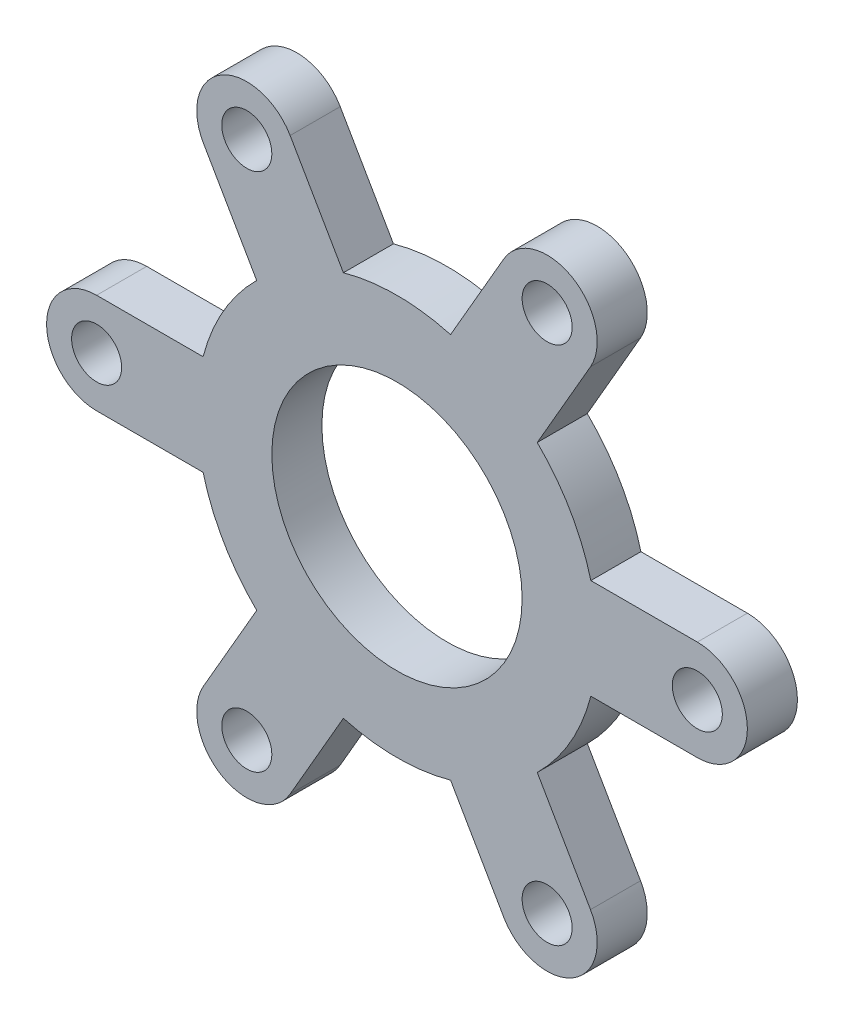
ISO-10303-21;
HEADER;
FILE_DESCRIPTION(('STEP AP214'),'2;1');
FILE_NAME('part.step','',(''),(''),'','','');
FILE_SCHEMA(('AUTOMOTIVE_DESIGN { 1 0 10303 214 1 1 1 1 }'));
ENDSEC;
DATA;
#1=APPLICATION_CONTEXT('core data for automotive mechanical design processes');
#2=APPLICATION_PROTOCOL_DEFINITION('international standard','automotive_design',2000,#1);
#3=PRODUCT_CONTEXT('',#1,'mechanical');
#4=PRODUCT('Part','Part','',(#3));
#5=PRODUCT_RELATED_PRODUCT_CATEGORY('part','',(#4));
#6=PRODUCT_DEFINITION_FORMATION('','',#4);
#7=PRODUCT_DEFINITION_CONTEXT('part definition',#1,'design');
#8=PRODUCT_DEFINITION('design','',#6,#7);
#9=PRODUCT_DEFINITION_SHAPE('','',#8);
#10=(LENGTH_UNIT() NAMED_UNIT(*) SI_UNIT(.MILLI.,.METRE.));
#11=(NAMED_UNIT(*) PLANE_ANGLE_UNIT() SI_UNIT($,.RADIAN.));
#12=(NAMED_UNIT(*) SI_UNIT($,.STERADIAN.) SOLID_ANGLE_UNIT());
#13=UNCERTAINTY_MEASURE_WITH_UNIT(LENGTH_MEASURE(1.E-05),#10,'distance_accuracy_value','');
#14=(GEOMETRIC_REPRESENTATION_CONTEXT(3) GLOBAL_UNCERTAINTY_ASSIGNED_CONTEXT((#13)) GLOBAL_UNIT_ASSIGNED_CONTEXT((#10,
#11,#12)) REPRESENTATION_CONTEXT('',''));
#15=CARTESIAN_POINT('',(0.,0.,0.));
#16=DIRECTION('',(0.,0.,1.));
#17=DIRECTION('',(1.,0.,0.));
#18=AXIS2_PLACEMENT_3D('',#15,#16,#17);
#19=CARTESIAN_POINT('',(60.,0.,10.));
#20=DIRECTION('',(0.,0.,1.));
#21=DIRECTION('',(1.,0.,0.));
#22=AXIS2_PLACEMENT_3D('',#19,#20,#21);
#23=PLANE('',#22);
#24=CARTESIAN_POINT('',(-30.0000000000002,51.9615242270651,10.));
#25=DIRECTION('',(0.,0.,1.));
#26=DIRECTION('',(1.,0.,0.));
#27=AXIS2_PLACEMENT_3D('',#24,#25,#26);
#28=CIRCLE('',#27,5.00000000000052);
#29=CARTESIAN_POINT('',(-24.9999999999997,51.9615242270651,10.));
#30=VERTEX_POINT('',#29);
#31=EDGE_CURVE('E459',#30,#30,#28,.T.);
#32=ORIENTED_EDGE('',*,*,#31,.F.);
#33=EDGE_LOOP('',(#32));
#34=FACE_BOUND('',#33,.T.);
#35=CARTESIAN_POINT('',(-30.0000000000002,-51.9615242270662,10.));
#36=DIRECTION('',(0.,0.,1.));
#37=DIRECTION('',(1.,0.,0.));
#38=AXIS2_PLACEMENT_3D('',#35,#36,#37);
#39=CIRCLE('',#38,5.00000000000001);
#40=CARTESIAN_POINT('',(-25.0000000000002,-51.9615242270662,10.));
#41=VERTEX_POINT('',#40);
#42=EDGE_CURVE('E471',#41,#41,#39,.T.);
#43=ORIENTED_EDGE('',*,*,#42,.F.);
#44=EDGE_LOOP('',(#43));
#45=FACE_BOUND('',#44,.T.);
#46=CARTESIAN_POINT('',(60.,0.,10.));
#47=DIRECTION('',(0.,0.,1.));
#48=DIRECTION('',(1.,0.,0.));
#49=AXIS2_PLACEMENT_3D('',#46,#47,#48);
#50=CIRCLE('',#49,5.);
#51=CARTESIAN_POINT('',(65.,0.,10.));
#52=VERTEX_POINT('',#51);
#53=EDGE_CURVE('E483',#52,#52,#50,.T.);
#54=ORIENTED_EDGE('',*,*,#53,.F.);
#55=EDGE_LOOP('',(#54));
#56=FACE_BOUND('',#55,.T.);
#57=CARTESIAN_POINT('',(60.,0.,10.));
#58=DIRECTION('',(0.,0.,1.));
#59=DIRECTION('',(1.,0.,0.));
#60=AXIS2_PLACEMENT_3D('',#57,#58,#59);
#61=CIRCLE('',#60,9.99999999999999);
#62=CARTESIAN_POINT('',(60.,-9.99999999999999,10.));
#63=VERTEX_POINT('',#62);
#64=CARTESIAN_POINT('',(60.,9.99999999999999,10.));
#65=VERTEX_POINT('',#64);
#66=EDGE_CURVE('E273',#63,#65,#61,.T.);
#67=ORIENTED_EDGE('',*,*,#66,.T.);
#68=DIRECTION('',(-1.,0.,0.));
#69=VECTOR('',#68,1.);
#70=CARTESIAN_POINT('',(60.,9.99999999999999,10.));
#71=LINE('',#70,#69);
#72=CARTESIAN_POINT('',(38.7298334620742,9.99999999999999,10.));
#73=VERTEX_POINT('',#72);
#74=EDGE_CURVE('E141',#65,#73,#71,.T.);
#75=ORIENTED_EDGE('',*,*,#74,.T.);
#76=CARTESIAN_POINT('',(0.,0.,10.));
#77=DIRECTION('',(0.,0.,1.));
#78=DIRECTION('',(1.,0.,0.));
#79=AXIS2_PLACEMENT_3D('',#76,#77,#78);
#80=CIRCLE('',#79,40.);
#81=CARTESIAN_POINT('',(28.0251707688818,28.5410196624965,10.));
#82=VERTEX_POINT('',#81);
#83=EDGE_CURVE('E336',#73,#82,#80,.T.);
#84=ORIENTED_EDGE('',*,*,#83,.T.);
#85=DIRECTION('',(0.50000000000001,0.866025403784433,0.));
#86=VECTOR('',#85,1.);
#87=CARTESIAN_POINT('',(38.6602540378449,46.9615242270659,10.));
#88=LINE('',#87,#86);
#89=CARTESIAN_POINT('',(38.6602540378449,46.9615242270659,10.));
#90=VERTEX_POINT('',#89);
#91=EDGE_CURVE('E355',#82,#90,#88,.T.);
#92=ORIENTED_EDGE('',*,*,#91,.T.);
#93=CARTESIAN_POINT('',(30.0000000000006,51.961524227066,10.));
#94=DIRECTION('',(0.,0.,1.));
#95=DIRECTION('',(1.,0.,0.));
#96=AXIS2_PLACEMENT_3D('',#93,#94,#95);
#97=CIRCLE('',#96,9.99999999999999);
#98=CARTESIAN_POINT('',(21.3397459621563,56.9615242270661,10.));
#99=VERTEX_POINT('',#98);
#100=EDGE_CURVE('E352',#90,#99,#97,.T.);
#101=ORIENTED_EDGE('',*,*,#100,.T.);
#102=DIRECTION('',(-0.50000000000001,-0.866025403784433,0.));
#103=VECTOR('',#102,1.);
#104=CARTESIAN_POINT('',(21.3397459621563,56.9615242270661,10.));
#105=LINE('',#104,#103);
#106=CARTESIAN_POINT('',(10.7046626931932,38.5410196624967,10.));
#107=VERTEX_POINT('',#106);
#108=EDGE_CURVE('E354',#99,#107,#105,.T.);
#109=ORIENTED_EDGE('',*,*,#108,.T.);
#110=CARTESIAN_POINT('',(0.,0.,10.));
#111=DIRECTION('',(0.,0.,1.));
#112=DIRECTION('',(1.,0.,0.));
#113=AXIS2_PLACEMENT_3D('',#110,#111,#112);
#114=CIRCLE('',#113,40.);
#115=CARTESIAN_POINT('',(-10.7046626931923,38.5410196624969,10.));
#116=VERTEX_POINT('',#115);
#117=EDGE_CURVE('E357',#107,#116,#114,.T.);
#118=ORIENTED_EDGE('',*,*,#117,.T.);
#119=DIRECTION('',(-0.500000000000049,0.86602540378441,0.));
#120=VECTOR('',#119,1.);
#121=CARTESIAN_POINT('',(-21.3397459621559,56.9615242270651,10.));
#122=LINE('',#121,#120);
#123=CARTESIAN_POINT('',(-21.3397459621559,56.9615242270651,10.));
#124=VERTEX_POINT('',#123);
#125=EDGE_CURVE('E363',#116,#124,#122,.T.);
#126=ORIENTED_EDGE('',*,*,#125,.T.);
#127=CARTESIAN_POINT('',(-30.0000000000002,51.9615242270651,10.));
#128=DIRECTION('',(0.,0.,1.));
#129=DIRECTION('',(1.,0.,0.));
#130=AXIS2_PLACEMENT_3D('',#127,#128,#129);
#131=CIRCLE('',#130,9.99999999999994);
#132=CARTESIAN_POINT('',(-38.6602540378445,46.9615242270651,10.));
#133=VERTEX_POINT('',#132);
#134=EDGE_CURVE('E365',#124,#133,#131,.T.);
#135=ORIENTED_EDGE('',*,*,#134,.T.);
#136=DIRECTION('',(0.500000000000045,-0.866025403784413,0.));
#137=VECTOR('',#136,1.);
#138=CARTESIAN_POINT('',(-38.6602540378445,46.9615242270651,10.));
#139=LINE('',#138,#137);
#140=CARTESIAN_POINT('',(-28.0251707688812,28.5410196624971,10.));
#141=VERTEX_POINT('',#140);
#142=EDGE_CURVE('E367',#133,#141,#139,.T.);
#143=ORIENTED_EDGE('',*,*,#142,.T.);
#144=CARTESIAN_POINT('',(0.,0.,10.));
#145=DIRECTION('',(0.,0.,1.));
#146=DIRECTION('',(1.,0.,0.));
#147=AXIS2_PLACEMENT_3D('',#144,#145,#146);
#148=CIRCLE('',#147,39.9999999999996);
#149=CARTESIAN_POINT('',(-38.7298334620741,9.99999999999877,10.));
#150=VERTEX_POINT('',#149);
#151=EDGE_CURVE('E369',#141,#150,#148,.T.);
#152=ORIENTED_EDGE('',*,*,#151,.T.);
#153=DIRECTION('',(-1.,0.,0.));
#154=VECTOR('',#153,1.);
#155=CARTESIAN_POINT('',(-59.9999999999995,9.99999999999867,10.));
#156=LINE('',#155,#154);
#157=CARTESIAN_POINT('',(-59.9999999999995,9.99999999999867,10.));
#158=VERTEX_POINT('',#157);
#159=EDGE_CURVE('E371',#150,#158,#156,.T.);
#160=ORIENTED_EDGE('',*,*,#159,.T.);
#161=CARTESIAN_POINT('',(-59.9999999999995,-1.32844943733665E-12,10.));
#162=DIRECTION('',(0.,0.,1.));
#163=DIRECTION('',(1.,0.,0.));
#164=AXIS2_PLACEMENT_3D('',#161,#162,#163);
#165=CIRCLE('',#164,9.99999999999998);
#166=CARTESIAN_POINT('',(-59.9999999999995,-10.0000000000013,10.));
#167=VERTEX_POINT('',#166);
#168=EDGE_CURVE('E373',#158,#167,#165,.T.);
#169=ORIENTED_EDGE('',*,*,#168,.T.);
#170=DIRECTION('',(1.,0.,0.));
#171=VECTOR('',#170,1.);
#172=CARTESIAN_POINT('',(-59.9999999999995,-10.0000000000013,10.));
#173=LINE('',#172,#171);
#174=CARTESIAN_POINT('',(-38.7298334620737,-10.0000000000013,10.));
#175=VERTEX_POINT('',#174);
#176=EDGE_CURVE('E375',#167,#175,#173,.T.);
#177=ORIENTED_EDGE('',*,*,#176,.T.);
#178=CARTESIAN_POINT('',(0.,0.,10.));
#179=DIRECTION('',(0.,0.,1.));
#180=DIRECTION('',(1.,0.,0.));
#181=AXIS2_PLACEMENT_3D('',#178,#179,#180);
#182=CIRCLE('',#181,39.9999999999999);
#183=CARTESIAN_POINT('',(-28.0251707688816,-28.5410196624967,10.));
#184=VERTEX_POINT('',#183);
#185=EDGE_CURVE('E377',#175,#184,#182,.T.);
#186=ORIENTED_EDGE('',*,*,#185,.T.);
#187=DIRECTION('',(-0.499999999999941,-0.866025403784473,0.));
#188=VECTOR('',#187,1.);
#189=CARTESIAN_POINT('',(-38.6602540378434,-46.9615242270671,10.));
#190=LINE('',#189,#188);
#191=CARTESIAN_POINT('',(-38.6602540378434,-46.9615242270671,10.));
#192=VERTEX_POINT('',#191);
#193=EDGE_CURVE('E379',#184,#192,#190,.T.);
#194=ORIENTED_EDGE('',*,*,#193,.T.);
#195=CARTESIAN_POINT('',(-30.0000000000002,-51.9615242270662,10.));
#196=DIRECTION('',(0.,0.,1.));
#197=DIRECTION('',(1.,0.,0.));
#198=AXIS2_PLACEMENT_3D('',#195,#196,#197);
#199=CIRCLE('',#198,9.99999999999923);
#200=CARTESIAN_POINT('',(-21.3397459621566,-56.9615242270659,10.));
#201=VERTEX_POINT('',#200);
#202=EDGE_CURVE('E381',#192,#201,#199,.T.);
#203=ORIENTED_EDGE('',*,*,#202,.T.);
#204=DIRECTION('',(0.500000000000004,0.866025403784436,0.));
#205=VECTOR('',#204,1.);
#206=CARTESIAN_POINT('',(-21.3397459621559,-56.9615242270662,10.));
#207=LINE('',#206,#205);
#208=CARTESIAN_POINT('',(-10.7046626931929,-38.5410196624968,10.));
#209=VERTEX_POINT('',#208);
#210=EDGE_CURVE('E383',#201,#209,#207,.T.);
#211=ORIENTED_EDGE('',*,*,#210,.T.);
#212=CARTESIAN_POINT('',(0.,0.,10.));
#213=DIRECTION('',(0.,0.,1.));
#214=DIRECTION('',(1.,0.,0.));
#215=AXIS2_PLACEMENT_3D('',#212,#213,#214);
#216=CIRCLE('',#215,40.);
#217=CARTESIAN_POINT('',(10.7046626931926,-38.5410196624969,10.));
#218=VERTEX_POINT('',#217);
#219=EDGE_CURVE('E385',#209,#218,#216,.T.);
#220=ORIENTED_EDGE('',*,*,#219,.T.);
#221=DIRECTION('',(0.499999999999998,-0.86602540378444,0.));
#222=VECTOR('',#221,1.);
#223=CARTESIAN_POINT('',(21.3397459621555,-56.9615242270664,10.));
#224=LINE('',#223,#222);
#225=CARTESIAN_POINT('',(21.3397459621555,-56.9615242270664,10.));
#226=VERTEX_POINT('',#225);
#227=EDGE_CURVE('E387',#218,#226,#224,.T.);
#228=ORIENTED_EDGE('',*,*,#227,.T.);
#229=CARTESIAN_POINT('',(29.9999999999999,-51.9615242270664,10.));
#230=DIRECTION('',(0.,0.,1.));
#231=DIRECTION('',(1.,0.,0.));
#232=AXIS2_PLACEMENT_3D('',#229,#230,#231);
#233=CIRCLE('',#232,9.99999999999999);
#234=CARTESIAN_POINT('',(38.6602540378443,-46.9615242270664,10.));
#235=VERTEX_POINT('',#234);
#236=EDGE_CURVE('E208',#226,#235,#233,.T.);
#237=ORIENTED_EDGE('',*,*,#236,.T.);
#238=DIRECTION('',(-0.499999999999998,0.86602540378444,0.));
#239=VECTOR('',#238,1.);
#240=CARTESIAN_POINT('',(38.6602540378443,-46.9615242270664,10.));
#241=LINE('',#240,#239);
#242=CARTESIAN_POINT('',(28.0251707688814,-28.5410196624969,10.));
#243=VERTEX_POINT('',#242);
#244=EDGE_CURVE('E202',#235,#243,#241,.T.);
#245=ORIENTED_EDGE('',*,*,#244,.T.);
#246=CARTESIAN_POINT('',(0.,0.,10.));
#247=DIRECTION('',(0.,0.,1.));
#248=DIRECTION('',(1.,0.,0.));
#249=AXIS2_PLACEMENT_3D('',#246,#247,#248);
#250=CIRCLE('',#249,40.);
#251=CARTESIAN_POINT('',(38.7298334620742,-10.,10.));
#252=VERTEX_POINT('',#251);
#253=EDGE_CURVE('E206',#243,#252,#250,.T.);
#254=ORIENTED_EDGE('',*,*,#253,.T.);
#255=DIRECTION('',(1.,0.,0.));
#256=VECTOR('',#255,1.);
#257=CARTESIAN_POINT('',(60.,-9.99999999999999,10.));
#258=LINE('',#257,#256);
#259=EDGE_CURVE('E50',#252,#63,#258,.T.);
#260=ORIENTED_EDGE('',*,*,#259,.T.);
#261=EDGE_LOOP('',(#67,#75,#84,#92,#101,#109,#118,#126,#135,#143,#152,#160,#169,#177,#186,#194,
#203,#211,#220,#228,#237,#245,#254,#260));
#262=FACE_BOUND('',#261,.T.);
#263=CARTESIAN_POINT('',(0.,0.,10.));
#264=DIRECTION('',(0.,0.,1.));
#265=DIRECTION('',(1.,0.,0.));
#266=AXIS2_PLACEMENT_3D('',#263,#264,#265);
#267=CIRCLE('',#266,25.);
#268=CARTESIAN_POINT('',(25.,0.,10.));
#269=VERTEX_POINT('',#268);
#270=EDGE_CURVE('E230',#269,#269,#267,.T.);
#271=ORIENTED_EDGE('',*,*,#270,.F.);
#272=EDGE_LOOP('',(#271));
#273=FACE_BOUND('',#272,.T.);
#274=CARTESIAN_POINT('',(29.9999999999999,-51.9615242270664,10.));
#275=DIRECTION('',(0.,0.,1.));
#276=DIRECTION('',(1.,0.,0.));
#277=AXIS2_PLACEMENT_3D('',#274,#275,#276);
#278=CIRCLE('',#277,5.00000000000001);
#279=CARTESIAN_POINT('',(34.9999999999999,-51.9615242270664,10.));
#280=VERTEX_POINT('',#279);
#281=EDGE_CURVE('E477',#280,#280,#278,.T.);
#282=ORIENTED_EDGE('',*,*,#281,.F.);
#283=EDGE_LOOP('',(#282));
#284=FACE_BOUND('',#283,.T.);
#285=CARTESIAN_POINT('',(-59.9999999999995,-1.32844943733665E-12,10.));
#286=DIRECTION('',(0.,0.,1.));
#287=DIRECTION('',(1.,0.,0.));
#288=AXIS2_PLACEMENT_3D('',#285,#286,#287);
#289=CIRCLE('',#288,4.99999999999999);
#290=CARTESIAN_POINT('',(-54.9999999999995,-1.32844943733665E-12,10.));
#291=VERTEX_POINT('',#290);
#292=EDGE_CURVE('E465',#291,#291,#289,.T.);
#293=ORIENTED_EDGE('',*,*,#292,.F.);
#294=EDGE_LOOP('',(#293));
#295=FACE_BOUND('',#294,.T.);
#296=CARTESIAN_POINT('',(30.0000000000006,51.961524227066,10.));
#297=DIRECTION('',(0.,0.,1.));
#298=DIRECTION('',(1.,0.,0.));
#299=AXIS2_PLACEMENT_3D('',#296,#297,#298);
#300=CIRCLE('',#299,5.);
#301=CARTESIAN_POINT('',(35.0000000000006,51.961524227066,10.));
#302=VERTEX_POINT('',#301);
#303=EDGE_CURVE('E450',#302,#302,#300,.T.);
#304=ORIENTED_EDGE('',*,*,#303,.F.);
#305=EDGE_LOOP('',(#304));
#306=FACE_BOUND('',#305,.T.);
#307=ADVANCED_FACE('F33',(#34,#45,#56,#262,#273,#284,#295,#306),#23,.T.);
#308=CARTESIAN_POINT('',(60.,0.,0.));
#309=DIRECTION('',(0.,0.,1.));
#310=DIRECTION('',(1.,0.,0.));
#311=AXIS2_PLACEMENT_3D('',#308,#309,#310);
#312=PLANE('',#311);
#313=CARTESIAN_POINT('',(60.,0.,0.));
#314=DIRECTION('',(0.,0.,1.));
#315=DIRECTION('',(1.,0.,0.));
#316=AXIS2_PLACEMENT_3D('',#313,#314,#315);
#317=CIRCLE('',#316,9.99999999999999);
#318=CARTESIAN_POINT('',(60.,-9.99999999999999,0.));
#319=VERTEX_POINT('',#318);
#320=CARTESIAN_POINT('',(60.,9.99999999999999,0.));
#321=VERTEX_POINT('',#320);
#322=EDGE_CURVE('E226',#319,#321,#317,.T.);
#323=ORIENTED_EDGE('',*,*,#322,.F.);
#324=DIRECTION('',(1.,0.,0.));
#325=VECTOR('',#324,1.);
#326=CARTESIAN_POINT('',(60.,-9.99999999999999,0.));
#327=LINE('',#326,#325);
#328=CARTESIAN_POINT('',(38.7298334620742,-10.,0.));
#329=VERTEX_POINT('',#328);
#330=EDGE_CURVE('E133',#329,#319,#327,.T.);
#331=ORIENTED_EDGE('',*,*,#330,.F.);
#332=CARTESIAN_POINT('',(0.,0.,0.));
#333=DIRECTION('',(0.,0.,1.));
#334=DIRECTION('',(1.,0.,0.));
#335=AXIS2_PLACEMENT_3D('',#332,#333,#334);
#336=CIRCLE('',#335,40.);
#337=CARTESIAN_POINT('',(28.0251707688814,-28.5410196624969,0.));
#338=VERTEX_POINT('',#337);
#339=EDGE_CURVE('E127',#338,#329,#336,.T.);
#340=ORIENTED_EDGE('',*,*,#339,.F.);
#341=DIRECTION('',(-0.499999999999998,0.86602540378444,0.));
#342=VECTOR('',#341,1.);
#343=CARTESIAN_POINT('',(38.6602540378443,-46.9615242270664,0.));
#344=LINE('',#343,#342);
#345=CARTESIAN_POINT('',(38.6602540378443,-46.9615242270664,0.));
#346=VERTEX_POINT('',#345);
#347=EDGE_CURVE('E216',#346,#338,#344,.T.);
#348=ORIENTED_EDGE('',*,*,#347,.F.);
#349=CARTESIAN_POINT('',(29.9999999999999,-51.9615242270664,0.));
#350=DIRECTION('',(0.,0.,1.));
#351=DIRECTION('',(1.,0.,0.));
#352=AXIS2_PLACEMENT_3D('',#349,#350,#351);
#353=CIRCLE('',#352,9.99999999999999);
#354=CARTESIAN_POINT('',(21.3397459621555,-56.9615242270664,0.));
#355=VERTEX_POINT('',#354);
#356=EDGE_CURVE('E268',#355,#346,#353,.T.);
#357=ORIENTED_EDGE('',*,*,#356,.F.);
#358=DIRECTION('',(0.499999999999998,-0.86602540378444,0.));
#359=VECTOR('',#358,1.);
#360=CARTESIAN_POINT('',(21.3397459621555,-56.9615242270664,0.));
#361=LINE('',#360,#359);
#362=CARTESIAN_POINT('',(10.7046626931926,-38.5410196624969,0.));
#363=VERTEX_POINT('',#362);
#364=EDGE_CURVE('E266',#363,#355,#361,.T.);
#365=ORIENTED_EDGE('',*,*,#364,.F.);
#366=CARTESIAN_POINT('',(0.,0.,0.));
#367=DIRECTION('',(0.,0.,1.));
#368=DIRECTION('',(1.,0.,0.));
#369=AXIS2_PLACEMENT_3D('',#366,#367,#368);
#370=CIRCLE('',#369,40.);
#371=CARTESIAN_POINT('',(-10.7046626931929,-38.5410196624968,0.));
#372=VERTEX_POINT('',#371);
#373=EDGE_CURVE('E264',#372,#363,#370,.T.);
#374=ORIENTED_EDGE('',*,*,#373,.F.);
#375=DIRECTION('',(0.500000000000004,0.866025403784436,0.));
#376=VECTOR('',#375,1.);
#377=CARTESIAN_POINT('',(-21.3397459621559,-56.9615242270662,0.));
#378=LINE('',#377,#376);
#379=CARTESIAN_POINT('',(-21.3397459621566,-56.9615242270659,0.));
#380=VERTEX_POINT('',#379);
#381=EDGE_CURVE('E262',#380,#372,#378,.T.);
#382=ORIENTED_EDGE('',*,*,#381,.F.);
#383=CARTESIAN_POINT('',(-30.0000000000002,-51.9615242270662,0.));
#384=DIRECTION('',(0.,0.,1.));
#385=DIRECTION('',(1.,0.,0.));
#386=AXIS2_PLACEMENT_3D('',#383,#384,#385);
#387=CIRCLE('',#386,9.99999999999923);
#388=CARTESIAN_POINT('',(-38.6602540378434,-46.9615242270671,0.));
#389=VERTEX_POINT('',#388);
#390=EDGE_CURVE('E260',#389,#380,#387,.T.);
#391=ORIENTED_EDGE('',*,*,#390,.F.);
#392=DIRECTION('',(-0.499999999999941,-0.866025403784473,0.));
#393=VECTOR('',#392,1.);
#394=CARTESIAN_POINT('',(-38.6602540378434,-46.9615242270671,0.));
#395=LINE('',#394,#393);
#396=CARTESIAN_POINT('',(-28.0251707688816,-28.5410196624967,0.));
#397=VERTEX_POINT('',#396);
#398=EDGE_CURVE('E258',#397,#389,#395,.T.);
#399=ORIENTED_EDGE('',*,*,#398,.F.);
#400=CARTESIAN_POINT('',(0.,0.,0.));
#401=DIRECTION('',(0.,0.,1.));
#402=DIRECTION('',(1.,0.,0.));
#403=AXIS2_PLACEMENT_3D('',#400,#401,#402);
#404=CIRCLE('',#403,39.9999999999999);
#405=CARTESIAN_POINT('',(-38.7298334620737,-10.0000000000013,0.));
#406=VERTEX_POINT('',#405);
#407=EDGE_CURVE('E256',#406,#397,#404,.T.);
#408=ORIENTED_EDGE('',*,*,#407,.F.);
#409=DIRECTION('',(1.,0.,0.));
#410=VECTOR('',#409,1.);
#411=CARTESIAN_POINT('',(-59.9999999999995,-10.0000000000013,0.));
#412=LINE('',#411,#410);
#413=CARTESIAN_POINT('',(-59.9999999999995,-10.0000000000013,0.));
#414=VERTEX_POINT('',#413);
#415=EDGE_CURVE('E254',#414,#406,#412,.T.);
#416=ORIENTED_EDGE('',*,*,#415,.F.);
#417=CARTESIAN_POINT('',(-59.9999999999995,-1.32844943733665E-12,0.));
#418=DIRECTION('',(0.,0.,1.));
#419=DIRECTION('',(1.,0.,0.));
#420=AXIS2_PLACEMENT_3D('',#417,#418,#419);
#421=CIRCLE('',#420,9.99999999999998);
#422=CARTESIAN_POINT('',(-59.9999999999995,9.99999999999867,0.));
#423=VERTEX_POINT('',#422);
#424=EDGE_CURVE('E252',#423,#414,#421,.T.);
#425=ORIENTED_EDGE('',*,*,#424,.F.);
#426=DIRECTION('',(-1.,0.,0.));
#427=VECTOR('',#426,1.);
#428=CARTESIAN_POINT('',(-59.9999999999995,9.99999999999867,0.));
#429=LINE('',#428,#427);
#430=CARTESIAN_POINT('',(-38.7298334620741,9.99999999999877,0.));
#431=VERTEX_POINT('',#430);
#432=EDGE_CURVE('E250',#431,#423,#429,.T.);
#433=ORIENTED_EDGE('',*,*,#432,.F.);
#434=CARTESIAN_POINT('',(0.,0.,0.));
#435=DIRECTION('',(0.,0.,1.));
#436=DIRECTION('',(1.,0.,0.));
#437=AXIS2_PLACEMENT_3D('',#434,#435,#436);
#438=CIRCLE('',#437,39.9999999999996);
#439=CARTESIAN_POINT('',(-28.0251707688812,28.5410196624971,0.));
#440=VERTEX_POINT('',#439);
#441=EDGE_CURVE('E248',#440,#431,#438,.T.);
#442=ORIENTED_EDGE('',*,*,#441,.F.);
#443=DIRECTION('',(0.500000000000045,-0.866025403784413,0.));
#444=VECTOR('',#443,1.);
#445=CARTESIAN_POINT('',(-38.6602540378445,46.9615242270651,0.));
#446=LINE('',#445,#444);
#447=CARTESIAN_POINT('',(-38.6602540378445,46.9615242270651,0.));
#448=VERTEX_POINT('',#447);
#449=EDGE_CURVE('E246',#448,#440,#446,.T.);
#450=ORIENTED_EDGE('',*,*,#449,.F.);
#451=CARTESIAN_POINT('',(-30.0000000000002,51.9615242270651,0.));
#452=DIRECTION('',(0.,0.,1.));
#453=DIRECTION('',(1.,0.,0.));
#454=AXIS2_PLACEMENT_3D('',#451,#452,#453);
#455=CIRCLE('',#454,9.99999999999994);
#456=CARTESIAN_POINT('',(-21.3397459621559,56.9615242270651,0.));
#457=VERTEX_POINT('',#456);
#458=EDGE_CURVE('E244',#457,#448,#455,.T.);
#459=ORIENTED_EDGE('',*,*,#458,.F.);
#460=DIRECTION('',(-0.500000000000049,0.86602540378441,0.));
#461=VECTOR('',#460,1.);
#462=CARTESIAN_POINT('',(-21.3397459621559,56.9615242270651,0.));
#463=LINE('',#462,#461);
#464=CARTESIAN_POINT('',(-10.7046626931923,38.5410196624969,0.));
#465=VERTEX_POINT('',#464);
#466=EDGE_CURVE('E242',#465,#457,#463,.T.);
#467=ORIENTED_EDGE('',*,*,#466,.F.);
#468=CARTESIAN_POINT('',(0.,0.,0.));
#469=DIRECTION('',(0.,0.,1.));
#470=DIRECTION('',(1.,0.,0.));
#471=AXIS2_PLACEMENT_3D('',#468,#469,#470);
#472=CIRCLE('',#471,40.);
#473=CARTESIAN_POINT('',(10.7046626931932,38.5410196624967,0.));
#474=VERTEX_POINT('',#473);
#475=EDGE_CURVE('E240',#474,#465,#472,.T.);
#476=ORIENTED_EDGE('',*,*,#475,.F.);
#477=DIRECTION('',(-0.50000000000001,-0.866025403784433,0.));
#478=VECTOR('',#477,1.);
#479=CARTESIAN_POINT('',(21.3397459621563,56.9615242270661,0.));
#480=LINE('',#479,#478);
#481=CARTESIAN_POINT('',(21.3397459621563,56.9615242270661,0.));
#482=VERTEX_POINT('',#481);
#483=EDGE_CURVE('E238',#482,#474,#480,.T.);
#484=ORIENTED_EDGE('',*,*,#483,.F.);
#485=CARTESIAN_POINT('',(30.0000000000006,51.961524227066,0.));
#486=DIRECTION('',(0.,0.,1.));
#487=DIRECTION('',(1.,0.,0.));
#488=AXIS2_PLACEMENT_3D('',#485,#486,#487);
#489=CIRCLE('',#488,9.99999999999999);
#490=CARTESIAN_POINT('',(38.6602540378449,46.9615242270659,0.));
#491=VERTEX_POINT('',#490);
#492=EDGE_CURVE('E236',#491,#482,#489,.T.);
#493=ORIENTED_EDGE('',*,*,#492,.F.);
#494=DIRECTION('',(0.50000000000001,0.866025403784433,0.));
#495=VECTOR('',#494,1.);
#496=CARTESIAN_POINT('',(38.6602540378449,46.9615242270659,0.));
#497=LINE('',#496,#495);
#498=CARTESIAN_POINT('',(28.0251707688818,28.5410196624965,0.));
#499=VERTEX_POINT('',#498);
#500=EDGE_CURVE('E234',#499,#491,#497,.T.);
#501=ORIENTED_EDGE('',*,*,#500,.F.);
#502=CARTESIAN_POINT('',(0.,0.,0.));
#503=DIRECTION('',(0.,0.,1.));
#504=DIRECTION('',(1.,0.,0.));
#505=AXIS2_PLACEMENT_3D('',#502,#503,#504);
#506=CIRCLE('',#505,40.);
#507=CARTESIAN_POINT('',(38.7298334620742,9.99999999999999,0.));
#508=VERTEX_POINT('',#507);
#509=EDGE_CURVE('E232',#508,#499,#506,.T.);
#510=ORIENTED_EDGE('',*,*,#509,.F.);
#511=DIRECTION('',(-1.,0.,0.));
#512=VECTOR('',#511,1.);
#513=CARTESIAN_POINT('',(60.,9.99999999999999,0.));
#514=LINE('',#513,#512);
#515=EDGE_CURVE('E229',#321,#508,#514,.T.);
#516=ORIENTED_EDGE('',*,*,#515,.F.);
#517=EDGE_LOOP('',(#323,#331,#340,#348,#357,#365,#374,#382,#391,#399,#408,#416,#425,#433,#442,
#450,#459,#467,#476,#484,#493,#501,#510,#516));
#518=FACE_BOUND('',#517,.T.);
#519=CARTESIAN_POINT('',(0.,0.,0.));
#520=DIRECTION('',(0.,0.,1.));
#521=DIRECTION('',(1.,0.,0.));
#522=AXIS2_PLACEMENT_3D('',#519,#520,#521);
#523=CIRCLE('',#522,25.);
#524=CARTESIAN_POINT('',(25.,0.,0.));
#525=VERTEX_POINT('',#524);
#526=EDGE_CURVE('E486',#525,#525,#523,.T.);
#527=ORIENTED_EDGE('',*,*,#526,.T.);
#528=EDGE_LOOP('',(#527));
#529=FACE_BOUND('',#528,.T.);
#530=CARTESIAN_POINT('',(60.,0.,0.));
#531=DIRECTION('',(0.,0.,1.));
#532=DIRECTION('',(1.,0.,0.));
#533=AXIS2_PLACEMENT_3D('',#530,#531,#532);
#534=CIRCLE('',#533,5.);
#535=CARTESIAN_POINT('',(65.,0.,0.));
#536=VERTEX_POINT('',#535);
#537=EDGE_CURVE('E480',#536,#536,#534,.T.);
#538=ORIENTED_EDGE('',*,*,#537,.T.);
#539=EDGE_LOOP('',(#538));
#540=FACE_BOUND('',#539,.T.);
#541=CARTESIAN_POINT('',(29.9999999999999,-51.9615242270664,0.));
#542=DIRECTION('',(0.,0.,1.));
#543=DIRECTION('',(1.,0.,0.));
#544=AXIS2_PLACEMENT_3D('',#541,#542,#543);
#545=CIRCLE('',#544,5.00000000000001);
#546=CARTESIAN_POINT('',(34.9999999999999,-51.9615242270664,0.));
#547=VERTEX_POINT('',#546);
#548=EDGE_CURVE('E474',#547,#547,#545,.T.);
#549=ORIENTED_EDGE('',*,*,#548,.T.);
#550=EDGE_LOOP('',(#549));
#551=FACE_BOUND('',#550,.T.);
#552=CARTESIAN_POINT('',(-30.0000000000002,-51.9615242270662,0.));
#553=DIRECTION('',(0.,0.,1.));
#554=DIRECTION('',(1.,0.,0.));
#555=AXIS2_PLACEMENT_3D('',#552,#553,#554);
#556=CIRCLE('',#555,5.00000000000001);
#557=CARTESIAN_POINT('',(-25.0000000000002,-51.9615242270662,0.));
#558=VERTEX_POINT('',#557);
#559=EDGE_CURVE('E468',#558,#558,#556,.T.);
#560=ORIENTED_EDGE('',*,*,#559,.T.);
#561=EDGE_LOOP('',(#560));
#562=FACE_BOUND('',#561,.T.);
#563=CARTESIAN_POINT('',(-59.9999999999995,-1.32844943733665E-12,0.));
#564=DIRECTION('',(0.,0.,1.));
#565=DIRECTION('',(1.,0.,0.));
#566=AXIS2_PLACEMENT_3D('',#563,#564,#565);
#567=CIRCLE('',#566,4.99999999999999);
#568=CARTESIAN_POINT('',(-54.9999999999995,-1.32844943733665E-12,0.));
#569=VERTEX_POINT('',#568);
#570=EDGE_CURVE('E462',#569,#569,#567,.T.);
#571=ORIENTED_EDGE('',*,*,#570,.T.);
#572=EDGE_LOOP('',(#571));
#573=FACE_BOUND('',#572,.T.);
#574=CARTESIAN_POINT('',(-30.0000000000002,51.9615242270651,0.));
#575=DIRECTION('',(0.,0.,1.));
#576=DIRECTION('',(1.,0.,0.));
#577=AXIS2_PLACEMENT_3D('',#574,#575,#576);
#578=CIRCLE('',#577,5.00000000000052);
#579=CARTESIAN_POINT('',(-24.9999999999997,51.9615242270651,0.));
#580=VERTEX_POINT('',#579);
#581=EDGE_CURVE('E456',#580,#580,#578,.T.);
#582=ORIENTED_EDGE('',*,*,#581,.T.);
#583=EDGE_LOOP('',(#582));
#584=FACE_BOUND('',#583,.T.);
#585=CARTESIAN_POINT('',(30.0000000000006,51.961524227066,0.));
#586=DIRECTION('',(0.,0.,1.));
#587=DIRECTION('',(1.,0.,0.));
#588=AXIS2_PLACEMENT_3D('',#585,#586,#587);
#589=CIRCLE('',#588,5.);
#590=CARTESIAN_POINT('',(35.0000000000006,51.961524227066,0.));
#591=VERTEX_POINT('',#590);
#592=EDGE_CURVE('E453',#591,#591,#589,.T.);
#593=ORIENTED_EDGE('',*,*,#592,.T.);
#594=EDGE_LOOP('',(#593));
#595=FACE_BOUND('',#594,.T.);
#596=ADVANCED_FACE('F340',(#518,#529,#540,#551,#562,#573,#584,#595),#312,.F.);
#597=CARTESIAN_POINT('',(60.,0.,10.));
#598=DIRECTION('',(0.,0.,-1.));
#599=DIRECTION('',(-1.,0.,0.));
#600=AXIS2_PLACEMENT_3D('',#597,#598,#599);
#601=CYLINDRICAL_SURFACE('',#600,9.99999999999999);
#602=ORIENTED_EDGE('',*,*,#322,.T.);
#603=DIRECTION('',(0.,0.,-1.));
#604=VECTOR('',#603,1.);
#605=CARTESIAN_POINT('',(60.,9.99999999999999,10.));
#606=LINE('',#605,#604);
#607=EDGE_CURVE('E11',#65,#321,#606,.T.);
#608=ORIENTED_EDGE('',*,*,#607,.F.);
#609=ORIENTED_EDGE('',*,*,#66,.F.);
#610=DIRECTION('',(0.,0.,-1.));
#611=VECTOR('',#610,1.);
#612=CARTESIAN_POINT('',(60.,-9.99999999999999,10.));
#613=LINE('',#612,#611);
#614=EDGE_CURVE('E222',#63,#319,#613,.T.);
#615=ORIENTED_EDGE('',*,*,#614,.T.);
#616=EDGE_LOOP('',(#602,#608,#609,#615));
#617=FACE_BOUND('',#616,.T.);
#618=ADVANCED_FACE('F35',(#617),#601,.T.);
#619=CARTESIAN_POINT('',(60.,9.99999999999999,10.));
#620=DIRECTION('',(0.,-1.,0.));
#621=DIRECTION('',(0.,0.,-1.));
#622=AXIS2_PLACEMENT_3D('',#619,#620,#621);
#623=PLANE('',#622);
#624=ORIENTED_EDGE('',*,*,#515,.T.);
#625=DIRECTION('',(0.,0.,-1.));
#626=VECTOR('',#625,1.);
#627=CARTESIAN_POINT('',(38.7298334620742,9.99999999999999,10.));
#628=LINE('',#627,#626);
#629=EDGE_CURVE('E42',#73,#508,#628,.T.);
#630=ORIENTED_EDGE('',*,*,#629,.F.);
#631=ORIENTED_EDGE('',*,*,#74,.F.);
#632=ORIENTED_EDGE('',*,*,#607,.T.);
#633=EDGE_LOOP('',(#624,#630,#631,#632));
#634=FACE_BOUND('',#633,.T.);
#635=ADVANCED_FACE('F743',(#634),#623,.F.);
#636=CARTESIAN_POINT('',(0.,0.,10.));
#637=DIRECTION('',(0.,0.,-1.));
#638=DIRECTION('',(-1.,0.,0.));
#639=AXIS2_PLACEMENT_3D('',#636,#637,#638);
#640=CYLINDRICAL_SURFACE('',#639,40.);
#641=ORIENTED_EDGE('',*,*,#509,.T.);
#642=DIRECTION('',(0.,0.,-1.));
#643=VECTOR('',#642,1.);
#644=CARTESIAN_POINT('',(28.0251707688818,28.5410196624965,10.));
#645=LINE('',#644,#643);
#646=EDGE_CURVE('E328',#82,#499,#645,.T.);
#647=ORIENTED_EDGE('',*,*,#646,.F.);
#648=ORIENTED_EDGE('',*,*,#83,.F.);
#649=ORIENTED_EDGE('',*,*,#629,.T.);
#650=EDGE_LOOP('',(#641,#647,#648,#649));
#651=FACE_BOUND('',#650,.T.);
#652=ADVANCED_FACE('F334',(#651),#640,.T.);
#653=CARTESIAN_POINT('',(38.6602540378449,46.9615242270659,10.));
#654=DIRECTION('',(-0.866025403784433,0.50000000000001,0.));
#655=DIRECTION('',(-0.50000000000001,-0.866025403784433,0.));
#656=AXIS2_PLACEMENT_3D('',#653,#654,#655);
#657=PLANE('',#656);
#658=ORIENTED_EDGE('',*,*,#500,.T.);
#659=DIRECTION('',(0.,0.,-1.));
#660=VECTOR('',#659,1.);
#661=CARTESIAN_POINT('',(38.6602540378449,46.9615242270659,10.));
#662=LINE('',#661,#660);
#663=EDGE_CURVE('E325',#90,#491,#662,.T.);
#664=ORIENTED_EDGE('',*,*,#663,.F.);
#665=ORIENTED_EDGE('',*,*,#91,.F.);
#666=ORIENTED_EDGE('',*,*,#646,.T.);
#667=EDGE_LOOP('',(#658,#664,#665,#666));
#668=FACE_BOUND('',#667,.T.);
#669=ADVANCED_FACE('F346',(#668),#657,.F.);
#670=CARTESIAN_POINT('',(30.0000000000006,51.961524227066,10.));
#671=DIRECTION('',(0.,0.,-1.));
#672=DIRECTION('',(-1.,0.,0.));
#673=AXIS2_PLACEMENT_3D('',#670,#671,#672);
#674=CYLINDRICAL_SURFACE('',#673,9.99999999999999);
#675=ORIENTED_EDGE('',*,*,#492,.T.);
#676=DIRECTION('',(0.,0.,-1.));
#677=VECTOR('',#676,1.);
#678=CARTESIAN_POINT('',(21.3397459621563,56.9615242270661,10.));
#679=LINE('',#678,#677);
#680=EDGE_CURVE('E322',#99,#482,#679,.T.);
#681=ORIENTED_EDGE('',*,*,#680,.F.);
#682=ORIENTED_EDGE('',*,*,#100,.F.);
#683=ORIENTED_EDGE('',*,*,#663,.T.);
#684=EDGE_LOOP('',(#675,#681,#682,#683));
#685=FACE_BOUND('',#684,.T.);
#686=ADVANCED_FACE('F350',(#685),#674,.T.);
#687=CARTESIAN_POINT('',(21.3397459621563,56.9615242270661,10.));
#688=DIRECTION('',(0.866025403784433,-0.50000000000001,0.));
#689=DIRECTION('',(0.50000000000001,0.866025403784433,0.));
#690=AXIS2_PLACEMENT_3D('',#687,#688,#689);
#691=PLANE('',#690);
#692=ORIENTED_EDGE('',*,*,#483,.T.);
#693=DIRECTION('',(0.,0.,-1.));
#694=VECTOR('',#693,1.);
#695=CARTESIAN_POINT('',(10.7046626931932,38.5410196624967,10.));
#696=LINE('',#695,#694);
#697=EDGE_CURVE('E319',#107,#474,#696,.T.);
#698=ORIENTED_EDGE('',*,*,#697,.F.);
#699=ORIENTED_EDGE('',*,*,#108,.F.);
#700=ORIENTED_EDGE('',*,*,#680,.T.);
#701=EDGE_LOOP('',(#692,#698,#699,#700));
#702=FACE_BOUND('',#701,.T.);
#703=ADVANCED_FACE('F708',(#702),#691,.F.);
#704=CARTESIAN_POINT('',(0.,0.,10.));
#705=DIRECTION('',(0.,0.,-1.));
#706=DIRECTION('',(-1.,0.,0.));
#707=AXIS2_PLACEMENT_3D('',#704,#705,#706);
#708=CYLINDRICAL_SURFACE('',#707,40.);
#709=ORIENTED_EDGE('',*,*,#475,.T.);
#710=DIRECTION('',(0.,0.,-1.));
#711=VECTOR('',#710,1.);
#712=CARTESIAN_POINT('',(-10.7046626931923,38.5410196624969,10.));
#713=LINE('',#712,#711);
#714=EDGE_CURVE('E316',#116,#465,#713,.T.);
#715=ORIENTED_EDGE('',*,*,#714,.F.);
#716=ORIENTED_EDGE('',*,*,#117,.F.);
#717=ORIENTED_EDGE('',*,*,#697,.T.);
#718=EDGE_LOOP('',(#709,#715,#716,#717));
#719=FACE_BOUND('',#718,.T.);
#720=ADVANCED_FACE('F698',(#719),#708,.T.);
#721=CARTESIAN_POINT('',(-21.3397459621559,56.9615242270651,10.));
#722=DIRECTION('',(-0.86602540378441,-0.500000000000049,0.));
#723=DIRECTION('',(0.500000000000049,-0.86602540378441,0.));
#724=AXIS2_PLACEMENT_3D('',#721,#722,#723);
#725=PLANE('',#724);
#726=ORIENTED_EDGE('',*,*,#466,.T.);
#727=DIRECTION('',(0.,0.,-1.));
#728=VECTOR('',#727,1.);
#729=CARTESIAN_POINT('',(-21.3397459621559,56.9615242270651,10.));
#730=LINE('',#729,#728);
#731=EDGE_CURVE('E313',#124,#457,#730,.T.);
#732=ORIENTED_EDGE('',*,*,#731,.F.);
#733=ORIENTED_EDGE('',*,*,#125,.F.);
#734=ORIENTED_EDGE('',*,*,#714,.T.);
#735=EDGE_LOOP('',(#726,#732,#733,#734));
#736=FACE_BOUND('',#735,.T.);
#737=ADVANCED_FACE('F688',(#736),#725,.F.);
#738=CARTESIAN_POINT('',(-30.0000000000002,51.9615242270651,10.));
#739=DIRECTION('',(0.,0.,-1.));
#740=DIRECTION('',(-1.,0.,0.));
#741=AXIS2_PLACEMENT_3D('',#738,#739,#740);
#742=CYLINDRICAL_SURFACE('',#741,9.99999999999994);
#743=ORIENTED_EDGE('',*,*,#458,.T.);
#744=DIRECTION('',(0.,0.,-1.));
#745=VECTOR('',#744,1.);
#746=CARTESIAN_POINT('',(-38.6602540378445,46.9615242270651,10.));
#747=LINE('',#746,#745);
#748=EDGE_CURVE('E310',#133,#448,#747,.T.);
#749=ORIENTED_EDGE('',*,*,#748,.F.);
#750=ORIENTED_EDGE('',*,*,#134,.F.);
#751=ORIENTED_EDGE('',*,*,#731,.T.);
#752=EDGE_LOOP('',(#743,#749,#750,#751));
#753=FACE_BOUND('',#752,.T.);
#754=ADVANCED_FACE('F678',(#753),#742,.T.);
#755=CARTESIAN_POINT('',(-38.6602540378445,46.9615242270651,10.));
#756=DIRECTION('',(0.866025403784413,0.500000000000045,0.));
#757=DIRECTION('',(-0.500000000000045,0.866025403784413,0.));
#758=AXIS2_PLACEMENT_3D('',#755,#756,#757);
#759=PLANE('',#758);
#760=ORIENTED_EDGE('',*,*,#449,.T.);
#761=DIRECTION('',(0.,0.,-1.));
#762=VECTOR('',#761,1.);
#763=CARTESIAN_POINT('',(-28.0251707688812,28.5410196624971,10.));
#764=LINE('',#763,#762);
#765=EDGE_CURVE('E307',#141,#440,#764,.T.);
#766=ORIENTED_EDGE('',*,*,#765,.F.);
#767=ORIENTED_EDGE('',*,*,#142,.F.);
#768=ORIENTED_EDGE('',*,*,#748,.T.);
#769=EDGE_LOOP('',(#760,#766,#767,#768));
#770=FACE_BOUND('',#769,.T.);
#771=ADVANCED_FACE('F668',(#770),#759,.F.);
#772=CARTESIAN_POINT('',(0.,0.,10.));
#773=DIRECTION('',(0.,0.,-1.));
#774=DIRECTION('',(-1.,0.,0.));
#775=AXIS2_PLACEMENT_3D('',#772,#773,#774);
#776=CYLINDRICAL_SURFACE('',#775,39.9999999999996);
#777=ORIENTED_EDGE('',*,*,#441,.T.);
#778=DIRECTION('',(0.,0.,-1.));
#779=VECTOR('',#778,1.);
#780=CARTESIAN_POINT('',(-38.7298334620741,9.99999999999877,10.));
#781=LINE('',#780,#779);
#782=EDGE_CURVE('E304',#150,#431,#781,.T.);
#783=ORIENTED_EDGE('',*,*,#782,.F.);
#784=ORIENTED_EDGE('',*,*,#151,.F.);
#785=ORIENTED_EDGE('',*,*,#765,.T.);
#786=EDGE_LOOP('',(#777,#783,#784,#785));
#787=FACE_BOUND('',#786,.T.);
#788=ADVANCED_FACE('F658',(#787),#776,.T.);
#789=CARTESIAN_POINT('',(-59.9999999999995,9.99999999999867,10.));
#790=DIRECTION('',(0.,-1.,0.));
#791=DIRECTION('',(1.,0.,0.));
#792=AXIS2_PLACEMENT_3D('',#789,#790,#791);
#793=PLANE('',#792);
#794=ORIENTED_EDGE('',*,*,#432,.T.);
#795=DIRECTION('',(0.,0.,-1.));
#796=VECTOR('',#795,1.);
#797=CARTESIAN_POINT('',(-59.9999999999995,9.99999999999867,10.));
#798=LINE('',#797,#796);
#799=EDGE_CURVE('E301',#158,#423,#798,.T.);
#800=ORIENTED_EDGE('',*,*,#799,.F.);
#801=ORIENTED_EDGE('',*,*,#159,.F.);
#802=ORIENTED_EDGE('',*,*,#782,.T.);
#803=EDGE_LOOP('',(#794,#800,#801,#802));
#804=FACE_BOUND('',#803,.T.);
#805=ADVANCED_FACE('F648',(#804),#793,.F.);
#806=CARTESIAN_POINT('',(-59.9999999999995,-1.32844943733665E-12,10.));
#807=DIRECTION('',(0.,0.,-1.));
#808=DIRECTION('',(-1.,0.,0.));
#809=AXIS2_PLACEMENT_3D('',#806,#807,#808);
#810=CYLINDRICAL_SURFACE('',#809,9.99999999999998);
#811=ORIENTED_EDGE('',*,*,#424,.T.);
#812=DIRECTION('',(0.,0.,-1.));
#813=VECTOR('',#812,1.);
#814=CARTESIAN_POINT('',(-59.9999999999995,-10.0000000000013,10.));
#815=LINE('',#814,#813);
#816=EDGE_CURVE('E298',#167,#414,#815,.T.);
#817=ORIENTED_EDGE('',*,*,#816,.F.);
#818=ORIENTED_EDGE('',*,*,#168,.F.);
#819=ORIENTED_EDGE('',*,*,#799,.T.);
#820=EDGE_LOOP('',(#811,#817,#818,#819));
#821=FACE_BOUND('',#820,.T.);
#822=ADVANCED_FACE('F638',(#821),#810,.T.);
#823=CARTESIAN_POINT('',(-59.9999999999995,-10.0000000000013,10.));
#824=DIRECTION('',(0.,1.,0.));
#825=DIRECTION('',(-1.,0.,0.));
#826=AXIS2_PLACEMENT_3D('',#823,#824,#825);
#827=PLANE('',#826);
#828=ORIENTED_EDGE('',*,*,#415,.T.);
#829=DIRECTION('',(0.,0.,-1.));
#830=VECTOR('',#829,1.);
#831=CARTESIAN_POINT('',(-38.7298334620737,-10.0000000000013,10.));
#832=LINE('',#831,#830);
#833=EDGE_CURVE('E295',#175,#406,#832,.T.);
#834=ORIENTED_EDGE('',*,*,#833,.F.);
#835=ORIENTED_EDGE('',*,*,#176,.F.);
#836=ORIENTED_EDGE('',*,*,#816,.T.);
#837=EDGE_LOOP('',(#828,#834,#835,#836));
#838=FACE_BOUND('',#837,.T.);
#839=ADVANCED_FACE('F628',(#838),#827,.F.);
#840=CARTESIAN_POINT('',(0.,0.,10.));
#841=DIRECTION('',(0.,0.,-1.));
#842=DIRECTION('',(-1.,0.,0.));
#843=AXIS2_PLACEMENT_3D('',#840,#841,#842);
#844=CYLINDRICAL_SURFACE('',#843,39.9999999999999);
#845=ORIENTED_EDGE('',*,*,#407,.T.);
#846=DIRECTION('',(0.,0.,-1.));
#847=VECTOR('',#846,1.);
#848=CARTESIAN_POINT('',(-28.0251707688816,-28.5410196624967,10.));
#849=LINE('',#848,#847);
#850=EDGE_CURVE('E292',#184,#397,#849,.T.);
#851=ORIENTED_EDGE('',*,*,#850,.F.);
#852=ORIENTED_EDGE('',*,*,#185,.F.);
#853=ORIENTED_EDGE('',*,*,#833,.T.);
#854=EDGE_LOOP('',(#845,#851,#852,#853));
#855=FACE_BOUND('',#854,.T.);
#856=ADVANCED_FACE('F618',(#855),#844,.T.);
#857=CARTESIAN_POINT('',(-38.6602540378434,-46.9615242270671,10.));
#858=DIRECTION('',(0.866025403784473,-0.499999999999941,0.));
#859=DIRECTION('',(0.499999999999941,0.866025403784473,0.));
#860=AXIS2_PLACEMENT_3D('',#857,#858,#859);
#861=PLANE('',#860);
#862=ORIENTED_EDGE('',*,*,#398,.T.);
#863=DIRECTION('',(0.,0.,-1.));
#864=VECTOR('',#863,1.);
#865=CARTESIAN_POINT('',(-38.6602540378434,-46.9615242270671,10.));
#866=LINE('',#865,#864);
#867=EDGE_CURVE('E289',#192,#389,#866,.T.);
#868=ORIENTED_EDGE('',*,*,#867,.F.);
#869=ORIENTED_EDGE('',*,*,#193,.F.);
#870=ORIENTED_EDGE('',*,*,#850,.T.);
#871=EDGE_LOOP('',(#862,#868,#869,#870));
#872=FACE_BOUND('',#871,.T.);
#873=ADVANCED_FACE('F608',(#872),#861,.F.);
#874=CARTESIAN_POINT('',(-30.0000000000002,-51.9615242270662,10.));
#875=DIRECTION('',(0.,0.,-1.));
#876=DIRECTION('',(-1.,0.,0.));
#877=AXIS2_PLACEMENT_3D('',#874,#875,#876);
#878=CYLINDRICAL_SURFACE('',#877,9.99999999999923);
#879=ORIENTED_EDGE('',*,*,#390,.T.);
#880=DIRECTION('',(0.,0.,-1.));
#881=VECTOR('',#880,1.);
#882=CARTESIAN_POINT('',(-21.3397459621566,-56.9615242270659,10.));
#883=LINE('',#882,#881);
#884=EDGE_CURVE('E286',#201,#380,#883,.T.);
#885=ORIENTED_EDGE('',*,*,#884,.F.);
#886=ORIENTED_EDGE('',*,*,#202,.F.);
#887=ORIENTED_EDGE('',*,*,#867,.T.);
#888=EDGE_LOOP('',(#879,#885,#886,#887));
#889=FACE_BOUND('',#888,.T.);
#890=ADVANCED_FACE('F598',(#889),#878,.T.);
#891=CARTESIAN_POINT('',(-21.3397459621559,-56.9615242270662,10.));
#892=DIRECTION('',(-0.866025403784436,0.500000000000004,0.));
#893=DIRECTION('',(-0.500000000000004,-0.866025403784436,0.));
#894=AXIS2_PLACEMENT_3D('',#891,#892,#893);
#895=PLANE('',#894);
#896=ORIENTED_EDGE('',*,*,#381,.T.);
#897=DIRECTION('',(0.,0.,-1.));
#898=VECTOR('',#897,1.);
#899=CARTESIAN_POINT('',(-10.7046626931929,-38.5410196624968,10.));
#900=LINE('',#899,#898);
#901=EDGE_CURVE('E283',#209,#372,#900,.T.);
#902=ORIENTED_EDGE('',*,*,#901,.F.);
#903=ORIENTED_EDGE('',*,*,#210,.F.);
#904=ORIENTED_EDGE('',*,*,#884,.T.);
#905=EDGE_LOOP('',(#896,#902,#903,#904));
#906=FACE_BOUND('',#905,.T.);
#907=ADVANCED_FACE('F588',(#906),#895,.F.);
#908=CARTESIAN_POINT('',(0.,0.,10.));
#909=DIRECTION('',(0.,0.,-1.));
#910=DIRECTION('',(-1.,0.,0.));
#911=AXIS2_PLACEMENT_3D('',#908,#909,#910);
#912=CYLINDRICAL_SURFACE('',#911,40.);
#913=ORIENTED_EDGE('',*,*,#373,.T.);
#914=DIRECTION('',(0.,0.,-1.));
#915=VECTOR('',#914,1.);
#916=CARTESIAN_POINT('',(10.7046626931926,-38.5410196624969,10.));
#917=LINE('',#916,#915);
#918=EDGE_CURVE('E280',#218,#363,#917,.T.);
#919=ORIENTED_EDGE('',*,*,#918,.F.);
#920=ORIENTED_EDGE('',*,*,#219,.F.);
#921=ORIENTED_EDGE('',*,*,#901,.T.);
#922=EDGE_LOOP('',(#913,#919,#920,#921));
#923=FACE_BOUND('',#922,.T.);
#924=ADVANCED_FACE('F579',(#923),#912,.T.);
#925=CARTESIAN_POINT('',(21.3397459621555,-56.9615242270664,10.));
#926=DIRECTION('',(0.86602540378444,0.499999999999998,0.));
#927=DIRECTION('',(-0.499999999999998,0.86602540378444,0.));
#928=AXIS2_PLACEMENT_3D('',#925,#926,#927);
#929=PLANE('',#928);
#930=ORIENTED_EDGE('',*,*,#364,.T.);
#931=DIRECTION('',(0.,0.,-1.));
#932=VECTOR('',#931,1.);
#933=CARTESIAN_POINT('',(21.3397459621555,-56.9615242270664,10.));
#934=LINE('',#933,#932);
#935=EDGE_CURVE('E277',#226,#355,#934,.T.);
#936=ORIENTED_EDGE('',*,*,#935,.F.);
#937=ORIENTED_EDGE('',*,*,#227,.F.);
#938=ORIENTED_EDGE('',*,*,#918,.T.);
#939=EDGE_LOOP('',(#930,#936,#937,#938));
#940=FACE_BOUND('',#939,.T.);
#941=ADVANCED_FACE('F393',(#940),#929,.F.);
#942=CARTESIAN_POINT('',(29.9999999999999,-51.9615242270664,10.));
#943=DIRECTION('',(0.,0.,-1.));
#944=DIRECTION('',(-1.,0.,0.));
#945=AXIS2_PLACEMENT_3D('',#942,#943,#944);
#946=CYLINDRICAL_SURFACE('',#945,9.99999999999999);
#947=ORIENTED_EDGE('',*,*,#356,.T.);
#948=DIRECTION('',(0.,0.,-1.));
#949=VECTOR('',#948,1.);
#950=CARTESIAN_POINT('',(38.6602540378443,-46.9615242270664,10.));
#951=LINE('',#950,#949);
#952=EDGE_CURVE('E217',#235,#346,#951,.T.);
#953=ORIENTED_EDGE('',*,*,#952,.F.);
#954=ORIENTED_EDGE('',*,*,#236,.F.);
#955=ORIENTED_EDGE('',*,*,#935,.T.);
#956=EDGE_LOOP('',(#947,#953,#954,#955));
#957=FACE_BOUND('',#956,.T.);
#958=ADVANCED_FACE('F397',(#957),#946,.T.);
#959=CARTESIAN_POINT('',(38.6602540378443,-46.9615242270664,10.));
#960=DIRECTION('',(-0.86602540378444,-0.499999999999998,0.));
#961=DIRECTION('',(0.499999999999998,-0.86602540378444,0.));
#962=AXIS2_PLACEMENT_3D('',#959,#960,#961);
#963=PLANE('',#962);
#964=ORIENTED_EDGE('',*,*,#347,.T.);
#965=DIRECTION('',(0.,0.,-1.));
#966=VECTOR('',#965,1.);
#967=CARTESIAN_POINT('',(28.0251707688814,-28.5410196624969,10.));
#968=LINE('',#967,#966);
#969=EDGE_CURVE('E213',#243,#338,#968,.T.);
#970=ORIENTED_EDGE('',*,*,#969,.F.);
#971=ORIENTED_EDGE('',*,*,#244,.F.);
#972=ORIENTED_EDGE('',*,*,#952,.T.);
#973=EDGE_LOOP('',(#964,#970,#971,#972));
#974=FACE_BOUND('',#973,.T.);
#975=ADVANCED_FACE('F214',(#974),#963,.F.);
#976=CARTESIAN_POINT('',(0.,0.,10.));
#977=DIRECTION('',(0.,0.,-1.));
#978=DIRECTION('',(-1.,0.,0.));
#979=AXIS2_PLACEMENT_3D('',#976,#977,#978);
#980=CYLINDRICAL_SURFACE('',#979,40.);
#981=ORIENTED_EDGE('',*,*,#339,.T.);
#982=DIRECTION('',(0.,0.,-1.));
#983=VECTOR('',#982,1.);
#984=CARTESIAN_POINT('',(38.7298334620742,-10.,10.));
#985=LINE('',#984,#983);
#986=EDGE_CURVE('E218',#252,#329,#985,.T.);
#987=ORIENTED_EDGE('',*,*,#986,.F.);
#988=ORIENTED_EDGE('',*,*,#253,.F.);
#989=ORIENTED_EDGE('',*,*,#969,.T.);
#990=EDGE_LOOP('',(#981,#987,#988,#989));
#991=FACE_BOUND('',#990,.T.);
#992=ADVANCED_FACE('F220',(#991),#980,.T.);
#993=CARTESIAN_POINT('',(60.,-9.99999999999999,10.));
#994=DIRECTION('',(0.,1.,0.));
#995=DIRECTION('',(0.,0.,1.));
#996=AXIS2_PLACEMENT_3D('',#993,#994,#995);
#997=PLANE('',#996);
#998=ORIENTED_EDGE('',*,*,#330,.T.);
#999=ORIENTED_EDGE('',*,*,#614,.F.);
#1000=ORIENTED_EDGE('',*,*,#259,.F.);
#1001=ORIENTED_EDGE('',*,*,#986,.T.);
#1002=EDGE_LOOP('',(#998,#999,#1000,#1001));
#1003=FACE_BOUND('',#1002,.T.);
#1004=ADVANCED_FACE('F401',(#1003),#997,.F.);
#1005=CARTESIAN_POINT('',(0.,0.,10.));
#1006=DIRECTION('',(0.,0.,-1.));
#1007=DIRECTION('',(-1.,0.,0.));
#1008=AXIS2_PLACEMENT_3D('',#1005,#1006,#1007);
#1009=CYLINDRICAL_SURFACE('',#1008,25.);
#1010=ORIENTED_EDGE('',*,*,#270,.T.);
#1011=EDGE_LOOP('',(#1010));
#1012=FACE_BOUND('',#1011,.T.);
#1013=ORIENTED_EDGE('',*,*,#526,.F.);
#1014=EDGE_LOOP('',(#1013));
#1015=FACE_BOUND('',#1014,.T.);
#1016=ADVANCED_FACE('F403',(#1012,#1015),#1009,.F.);
#1017=CARTESIAN_POINT('',(60.,0.,10.));
#1018=DIRECTION('',(0.,0.,-1.));
#1019=DIRECTION('',(-1.,0.,0.));
#1020=AXIS2_PLACEMENT_3D('',#1017,#1018,#1019);
#1021=CYLINDRICAL_SURFACE('',#1020,5.);
#1022=ORIENTED_EDGE('',*,*,#53,.T.);
#1023=EDGE_LOOP('',(#1022));
#1024=FACE_BOUND('',#1023,.T.);
#1025=ORIENTED_EDGE('',*,*,#537,.F.);
#1026=EDGE_LOOP('',(#1025));
#1027=FACE_BOUND('',#1026,.T.);
#1028=ADVANCED_FACE('F409',(#1024,#1027),#1021,.F.);
#1029=CARTESIAN_POINT('',(29.9999999999999,-51.9615242270664,10.));
#1030=DIRECTION('',(0.,0.,-1.));
#1031=DIRECTION('',(-1.,0.,0.));
#1032=AXIS2_PLACEMENT_3D('',#1029,#1030,#1031);
#1033=CYLINDRICAL_SURFACE('',#1032,5.00000000000001);
#1034=ORIENTED_EDGE('',*,*,#281,.T.);
#1035=EDGE_LOOP('',(#1034));
#1036=FACE_BOUND('',#1035,.T.);
#1037=ORIENTED_EDGE('',*,*,#548,.F.);
#1038=EDGE_LOOP('',(#1037));
#1039=FACE_BOUND('',#1038,.T.);
#1040=ADVANCED_FACE('F425',(#1036,#1039),#1033,.F.);
#1041=CARTESIAN_POINT('',(-30.0000000000002,-51.9615242270662,10.));
#1042=DIRECTION('',(0.,0.,-1.));
#1043=DIRECTION('',(-1.,0.,0.));
#1044=AXIS2_PLACEMENT_3D('',#1041,#1042,#1043);
#1045=CYLINDRICAL_SURFACE('',#1044,5.00000000000001);
#1046=ORIENTED_EDGE('',*,*,#42,.T.);
#1047=EDGE_LOOP('',(#1046));
#1048=FACE_BOUND('',#1047,.T.);
#1049=ORIENTED_EDGE('',*,*,#559,.F.);
#1050=EDGE_LOOP('',(#1049));
#1051=FACE_BOUND('',#1050,.T.);
#1052=ADVANCED_FACE('F429',(#1048,#1051),#1045,.F.);
#1053=CARTESIAN_POINT('',(-59.9999999999995,-1.32844943733665E-12,10.));
#1054=DIRECTION('',(0.,0.,-1.));
#1055=DIRECTION('',(-1.,0.,0.));
#1056=AXIS2_PLACEMENT_3D('',#1053,#1054,#1055);
#1057=CYLINDRICAL_SURFACE('',#1056,4.99999999999999);
#1058=ORIENTED_EDGE('',*,*,#292,.T.);
#1059=EDGE_LOOP('',(#1058));
#1060=FACE_BOUND('',#1059,.T.);
#1061=ORIENTED_EDGE('',*,*,#570,.F.);
#1062=EDGE_LOOP('',(#1061));
#1063=FACE_BOUND('',#1062,.T.);
#1064=ADVANCED_FACE('F433',(#1060,#1063),#1057,.F.);
#1065=CARTESIAN_POINT('',(-30.0000000000002,51.9615242270651,10.));
#1066=DIRECTION('',(0.,0.,-1.));
#1067=DIRECTION('',(-1.,0.,0.));
#1068=AXIS2_PLACEMENT_3D('',#1065,#1066,#1067);
#1069=CYLINDRICAL_SURFACE('',#1068,5.00000000000052);
#1070=ORIENTED_EDGE('',*,*,#31,.T.);
#1071=EDGE_LOOP('',(#1070));
#1072=FACE_BOUND('',#1071,.T.);
#1073=ORIENTED_EDGE('',*,*,#581,.F.);
#1074=EDGE_LOOP('',(#1073));
#1075=FACE_BOUND('',#1074,.T.);
#1076=ADVANCED_FACE('F437',(#1072,#1075),#1069,.F.);
#1077=CARTESIAN_POINT('',(30.0000000000006,51.961524227066,10.));
#1078=DIRECTION('',(0.,0.,-1.));
#1079=DIRECTION('',(-1.,0.,0.));
#1080=AXIS2_PLACEMENT_3D('',#1077,#1078,#1079);
#1081=CYLINDRICAL_SURFACE('',#1080,5.);
#1082=ORIENTED_EDGE('',*,*,#303,.T.);
#1083=EDGE_LOOP('',(#1082));
#1084=FACE_BOUND('',#1083,.T.);
#1085=ORIENTED_EDGE('',*,*,#592,.F.);
#1086=EDGE_LOOP('',(#1085));
#1087=FACE_BOUND('',#1086,.T.);
#1088=ADVANCED_FACE('F441',(#1084,#1087),#1081,.F.);
#1089=CLOSED_SHELL('',(#307,#596,#618,#635,#652,#669,#686,#703,#720,#737,#754,#771,#788,#805,
#822,#839,#856,#873,#890,#907,#924,#941,#958,#975,#992,#1004,#1016,#1028,#1040,#1052,#1064,
#1076,#1088));
#1090=MANIFOLD_SOLID_BREP('B2',#1089);
#1091=ADVANCED_BREP_SHAPE_REPRESENTATION('',(#18,#1090),#14);
#1092=SHAPE_DEFINITION_REPRESENTATION(#9,#1091);
ENDSEC;
END-ISO-10303-21;
